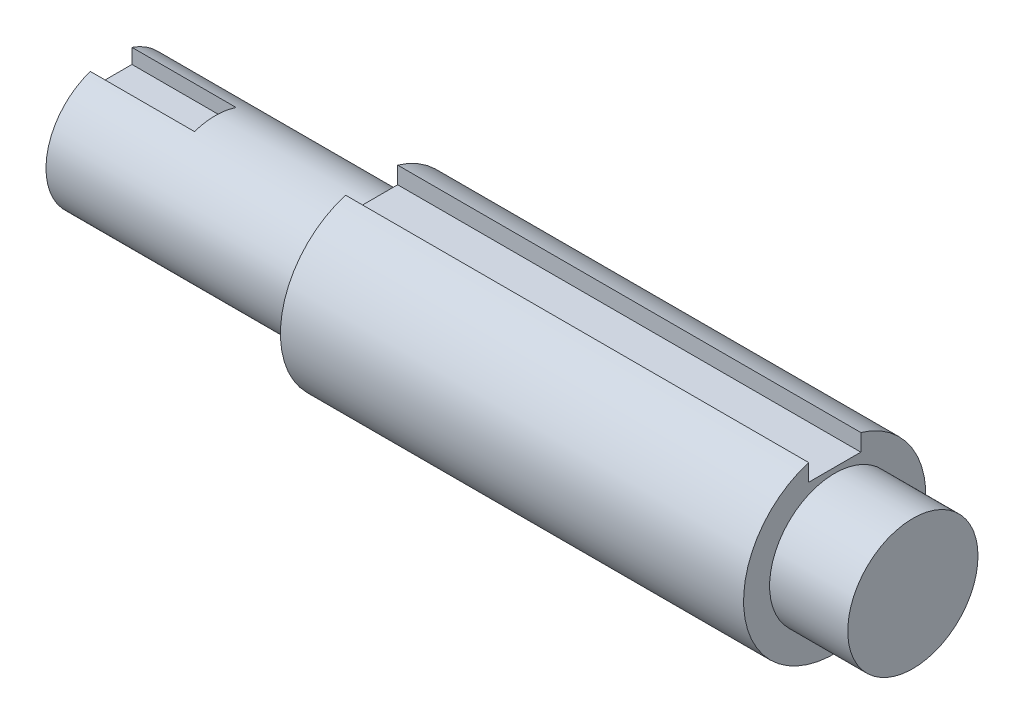
ISO-10303-21;
HEADER;
FILE_DESCRIPTION(('STEP AP214'),'2;1');
FILE_NAME('part.step','',(''),(''),'','','');
FILE_SCHEMA(('AUTOMOTIVE_DESIGN { 1 0 10303 214 1 1 1 1 }'));
ENDSEC;
DATA;
#1=APPLICATION_CONTEXT('core data for automotive mechanical design processes');
#2=APPLICATION_PROTOCOL_DEFINITION('international standard','automotive_design',2000,#1);
#3=PRODUCT_CONTEXT('',#1,'mechanical');
#4=PRODUCT('Part','Part','',(#3));
#5=PRODUCT_RELATED_PRODUCT_CATEGORY('part','',(#4));
#6=PRODUCT_DEFINITION_FORMATION('','',#4);
#7=PRODUCT_DEFINITION_CONTEXT('part definition',#1,'design');
#8=PRODUCT_DEFINITION('design','',#6,#7);
#9=PRODUCT_DEFINITION_SHAPE('','',#8);
#10=(LENGTH_UNIT() NAMED_UNIT(*) SI_UNIT(.MILLI.,.METRE.));
#11=(NAMED_UNIT(*) PLANE_ANGLE_UNIT() SI_UNIT($,.RADIAN.));
#12=(NAMED_UNIT(*) SI_UNIT($,.STERADIAN.) SOLID_ANGLE_UNIT());
#13=UNCERTAINTY_MEASURE_WITH_UNIT(LENGTH_MEASURE(1.E-05),#10,'distance_accuracy_value','');
#14=(GEOMETRIC_REPRESENTATION_CONTEXT(3) GLOBAL_UNCERTAINTY_ASSIGNED_CONTEXT((#13)) GLOBAL_UNIT_ASSIGNED_CONTEXT((#10,
#11,#12)) REPRESENTATION_CONTEXT('',''));
#15=CARTESIAN_POINT('',(0.,0.,0.));
#16=DIRECTION('',(0.,0.,1.));
#17=DIRECTION('',(1.,0.,0.));
#18=AXIS2_PLACEMENT_3D('',#15,#16,#17);
#19=CARTESIAN_POINT('',(20.,0.,4.));
#20=DIRECTION('',(0.,0.,-1.));
#21=DIRECTION('',(0.,1.,0.));
#22=AXIS2_PLACEMENT_3D('',#19,#20,#21);
#23=PLANE('',#22);
#24=DIRECTION('',(0.,-1.,0.));
#25=VECTOR('',#24,1.);
#26=CARTESIAN_POINT('',(0.,0.,4.));
#27=LINE('',#26,#25);
#28=CARTESIAN_POINT('',(0.,11.842719282327,4.));
#29=VERTEX_POINT('',#28);
#30=CARTESIAN_POINT('',(0.,9.,4.));
#31=VERTEX_POINT('',#30);
#32=EDGE_CURVE('E178',#29,#31,#27,.T.);
#33=ORIENTED_EDGE('',*,*,#32,.F.);
#34=DIRECTION('',(-1.,0.,0.));
#35=VECTOR('',#34,1.);
#36=CARTESIAN_POINT('',(20.,11.842719282327,4.));
#37=LINE('',#36,#35);
#38=CARTESIAN_POINT('',(20.,11.842719282327,4.));
#39=VERTEX_POINT('',#38);
#40=EDGE_CURVE('E11',#39,#29,#37,.T.);
#41=ORIENTED_EDGE('',*,*,#40,.F.);
#42=DIRECTION('',(0.,-1.,0.));
#43=VECTOR('',#42,1.);
#44=CARTESIAN_POINT('',(20.,0.,4.));
#45=LINE('',#44,#43);
#46=CARTESIAN_POINT('',(20.,9.,4.));
#47=VERTEX_POINT('',#46);
#48=EDGE_CURVE('E179',#39,#47,#45,.T.);
#49=ORIENTED_EDGE('',*,*,#48,.T.);
#50=DIRECTION('',(-1.,0.,0.));
#51=VECTOR('',#50,1.);
#52=CARTESIAN_POINT('',(20.,9.,4.));
#53=LINE('',#52,#51);
#54=EDGE_CURVE('E81',#47,#31,#53,.T.);
#55=ORIENTED_EDGE('',*,*,#54,.T.);
#56=EDGE_LOOP('',(#33,#41,#49,#55));
#57=FACE_BOUND('',#56,.T.);
#58=ADVANCED_FACE('F43',(#57),#23,.T.);
#59=CARTESIAN_POINT('',(20.,0.,0.));
#60=DIRECTION('',(-1.,0.,0.));
#61=DIRECTION('',(0.,0.,1.));
#62=AXIS2_PLACEMENT_3D('',#59,#60,#61);
#63=CYLINDRICAL_SURFACE('',#62,12.5);
#64=CARTESIAN_POINT('',(0.,0.,0.));
#65=DIRECTION('',(1.,0.,0.));
#66=DIRECTION('',(0.,0.,-1.));
#67=AXIS2_PLACEMENT_3D('',#64,#65,#66);
#68=CIRCLE('',#67,12.5);
#69=CARTESIAN_POINT('',(0.,11.842719282327,-4.));
#70=VERTEX_POINT('',#69);
#71=EDGE_CURVE('E194',#29,#70,#68,.T.);
#72=ORIENTED_EDGE('',*,*,#71,.T.);
#73=DIRECTION('',(-1.,0.,0.));
#74=VECTOR('',#73,1.);
#75=CARTESIAN_POINT('',(20.,11.842719282327,-4.));
#76=LINE('',#75,#74);
#77=CARTESIAN_POINT('',(20.,11.842719282327,-4.));
#78=VERTEX_POINT('',#77);
#79=EDGE_CURVE('E52',#78,#70,#76,.T.);
#80=ORIENTED_EDGE('',*,*,#79,.F.);
#81=CARTESIAN_POINT('',(20.,0.,0.));
#82=DIRECTION('',(1.,0.,0.));
#83=DIRECTION('',(0.,0.,-1.));
#84=AXIS2_PLACEMENT_3D('',#81,#82,#83);
#85=CIRCLE('',#84,12.5);
#86=EDGE_CURVE('E174',#78,#39,#85,.T.);
#87=ORIENTED_EDGE('',*,*,#86,.T.);
#88=ORIENTED_EDGE('',*,*,#40,.T.);
#89=EDGE_LOOP('',(#72,#80,#87,#88));
#90=FACE_BOUND('',#89,.T.);
#91=CARTESIAN_POINT('',(50.,0.,0.));
#92=DIRECTION('',(1.,0.,0.));
#93=DIRECTION('',(0.,0.,-1.));
#94=AXIS2_PLACEMENT_3D('',#91,#92,#93);
#95=CIRCLE('',#94,12.5);
#96=CARTESIAN_POINT('',(50.,0.,-12.5));
#97=VERTEX_POINT('',#96);
#98=EDGE_CURVE('E123',#97,#97,#95,.T.);
#99=ORIENTED_EDGE('',*,*,#98,.F.);
#100=EDGE_LOOP('',(#99));
#101=FACE_BOUND('',#100,.T.);
#102=ADVANCED_FACE('F216',(#90,#101),#63,.T.);
#103=CARTESIAN_POINT('',(20.,0.,-4.));
#104=DIRECTION('',(0.,0.,-1.));
#105=DIRECTION('',(0.,1.,0.));
#106=AXIS2_PLACEMENT_3D('',#103,#104,#105);
#107=PLANE('',#106);
#108=DIRECTION('',(0.,-1.,0.));
#109=VECTOR('',#108,1.);
#110=CARTESIAN_POINT('',(0.,0.,-4.));
#111=LINE('',#110,#109);
#112=CARTESIAN_POINT('',(0.,9.,-4.));
#113=VERTEX_POINT('',#112);
#114=EDGE_CURVE('E75',#70,#113,#111,.T.);
#115=ORIENTED_EDGE('',*,*,#114,.T.);
#116=DIRECTION('',(-1.,0.,0.));
#117=VECTOR('',#116,1.);
#118=CARTESIAN_POINT('',(20.,9.,-4.));
#119=LINE('',#118,#117);
#120=CARTESIAN_POINT('',(20.,9.,-4.));
#121=VERTEX_POINT('',#120);
#122=EDGE_CURVE('E60',#121,#113,#119,.T.);
#123=ORIENTED_EDGE('',*,*,#122,.F.);
#124=DIRECTION('',(0.,-1.,0.));
#125=VECTOR('',#124,1.);
#126=CARTESIAN_POINT('',(20.,0.,-4.));
#127=LINE('',#126,#125);
#128=EDGE_CURVE('E182',#78,#121,#127,.T.);
#129=ORIENTED_EDGE('',*,*,#128,.F.);
#130=ORIENTED_EDGE('',*,*,#79,.T.);
#131=EDGE_LOOP('',(#115,#123,#129,#130));
#132=FACE_BOUND('',#131,.T.);
#133=ADVANCED_FACE('F205',(#132),#107,.F.);
#134=CARTESIAN_POINT('',(20.,9.,0.));
#135=DIRECTION('',(0.,-1.,0.));
#136=DIRECTION('',(0.,0.,-1.));
#137=AXIS2_PLACEMENT_3D('',#134,#135,#136);
#138=PLANE('',#137);
#139=DIRECTION('',(0.,0.,1.));
#140=VECTOR('',#139,1.);
#141=CARTESIAN_POINT('',(0.,9.,0.));
#142=LINE('',#141,#140);
#143=EDGE_CURVE('E183',#113,#31,#142,.T.);
#144=ORIENTED_EDGE('',*,*,#143,.T.);
#145=ORIENTED_EDGE('',*,*,#54,.F.);
#146=DIRECTION('',(0.,0.,1.));
#147=VECTOR('',#146,1.);
#148=CARTESIAN_POINT('',(20.,9.,0.));
#149=LINE('',#148,#147);
#150=EDGE_CURVE('E187',#121,#47,#149,.T.);
#151=ORIENTED_EDGE('',*,*,#150,.F.);
#152=ORIENTED_EDGE('',*,*,#122,.T.);
#153=EDGE_LOOP('',(#144,#145,#151,#152));
#154=FACE_BOUND('',#153,.T.);
#155=ADVANCED_FACE('F213',(#154),#138,.F.);
#156=CARTESIAN_POINT('',(0.,0.,0.));
#157=DIRECTION('',(1.,0.,0.));
#158=DIRECTION('',(0.,0.,-1.));
#159=AXIS2_PLACEMENT_3D('',#156,#157,#158);
#160=PLANE('',#159);
#161=ORIENTED_EDGE('',*,*,#32,.T.);
#162=ORIENTED_EDGE('',*,*,#143,.F.);
#163=ORIENTED_EDGE('',*,*,#114,.F.);
#164=ORIENTED_EDGE('',*,*,#71,.F.);
#165=EDGE_LOOP('',(#161,#162,#163,#164));
#166=FACE_BOUND('',#165,.T.);
#167=ADVANCED_FACE('F211',(#166),#160,.F.);
#168=CARTESIAN_POINT('',(20.,0.,0.));
#169=DIRECTION('',(1.,0.,0.));
#170=DIRECTION('',(0.,0.,-1.));
#171=AXIS2_PLACEMENT_3D('',#168,#169,#170);
#172=PLANE('',#171);
#173=ORIENTED_EDGE('',*,*,#48,.F.);
#174=ORIENTED_EDGE('',*,*,#86,.F.);
#175=ORIENTED_EDGE('',*,*,#128,.T.);
#176=ORIENTED_EDGE('',*,*,#150,.T.);
#177=EDGE_LOOP('',(#173,#174,#175,#176));
#178=FACE_BOUND('',#177,.T.);
#179=ADVANCED_FACE('F215',(#178),#172,.F.);
#180=CARTESIAN_POINT('',(138.9,0.,5.));
#181=DIRECTION('',(0.,0.,-1.));
#182=DIRECTION('',(0.,1.,0.));
#183=AXIS2_PLACEMENT_3D('',#180,#181,#182);
#184=PLANE('',#183);
#185=DIRECTION('',(0.,-1.,0.));
#186=VECTOR('',#185,1.);
#187=CARTESIAN_POINT('',(50.,0.,5.));
#188=LINE('',#187,#186);
#189=CARTESIAN_POINT('',(50.,16.7705098312484,5.));
#190=VERTEX_POINT('',#189);
#191=CARTESIAN_POINT('',(50.,13.5,5.));
#192=VERTEX_POINT('',#191);
#193=EDGE_CURVE('E119',#190,#192,#188,.T.);
#194=ORIENTED_EDGE('',*,*,#193,.F.);
#195=DIRECTION('',(-1.,0.,0.));
#196=VECTOR('',#195,1.);
#197=CARTESIAN_POINT('',(138.9,16.7705098312484,5.));
#198=LINE('',#197,#196);
#199=CARTESIAN_POINT('',(138.9,16.7705098312484,5.));
#200=VERTEX_POINT('',#199);
#201=EDGE_CURVE('E113',#200,#190,#198,.T.);
#202=ORIENTED_EDGE('',*,*,#201,.F.);
#203=DIRECTION('',(0.,-1.,0.));
#204=VECTOR('',#203,1.);
#205=CARTESIAN_POINT('',(138.9,0.,5.));
#206=LINE('',#205,#204);
#207=CARTESIAN_POINT('',(138.9,13.5,5.));
#208=VERTEX_POINT('',#207);
#209=EDGE_CURVE('E117',#200,#208,#206,.T.);
#210=ORIENTED_EDGE('',*,*,#209,.T.);
#211=DIRECTION('',(-1.,0.,0.));
#212=VECTOR('',#211,1.);
#213=CARTESIAN_POINT('',(138.9,13.5,5.));
#214=LINE('',#213,#212);
#215=EDGE_CURVE('E154',#208,#192,#214,.T.);
#216=ORIENTED_EDGE('',*,*,#215,.T.);
#217=EDGE_LOOP('',(#194,#202,#210,#216));
#218=FACE_BOUND('',#217,.T.);
#219=ADVANCED_FACE('F115',(#218),#184,.T.);
#220=CARTESIAN_POINT('',(138.9,0.,0.));
#221=DIRECTION('',(-1.,0.,0.));
#222=DIRECTION('',(0.,0.,1.));
#223=AXIS2_PLACEMENT_3D('',#220,#221,#222);
#224=CYLINDRICAL_SURFACE('',#223,17.5);
#225=CARTESIAN_POINT('',(50.,0.,0.));
#226=DIRECTION('',(1.,0.,0.));
#227=DIRECTION('',(0.,0.,-1.));
#228=AXIS2_PLACEMENT_3D('',#225,#226,#227);
#229=CIRCLE('',#228,17.5);
#230=CARTESIAN_POINT('',(50.,16.7705098312484,-5.));
#231=VERTEX_POINT('',#230);
#232=EDGE_CURVE('E157',#190,#231,#229,.T.);
#233=ORIENTED_EDGE('',*,*,#232,.T.);
#234=DIRECTION('',(-1.,0.,0.));
#235=VECTOR('',#234,1.);
#236=CARTESIAN_POINT('',(138.9,16.7705098312484,-5.));
#237=LINE('',#236,#235);
#238=CARTESIAN_POINT('',(138.9,16.7705098312484,-5.));
#239=VERTEX_POINT('',#238);
#240=EDGE_CURVE('E124',#239,#231,#237,.T.);
#241=ORIENTED_EDGE('',*,*,#240,.F.);
#242=CARTESIAN_POINT('',(138.9,0.,0.));
#243=DIRECTION('',(1.,0.,0.));
#244=DIRECTION('',(0.,0.,-1.));
#245=AXIS2_PLACEMENT_3D('',#242,#243,#244);
#246=CIRCLE('',#245,17.5);
#247=EDGE_CURVE('E127',#200,#239,#246,.T.);
#248=ORIENTED_EDGE('',*,*,#247,.F.);
#249=ORIENTED_EDGE('',*,*,#201,.T.);
#250=EDGE_LOOP('',(#233,#241,#248,#249));
#251=FACE_BOUND('',#250,.T.);
#252=ADVANCED_FACE('F128',(#251),#224,.T.);
#253=CARTESIAN_POINT('',(138.9,0.,-5.));
#254=DIRECTION('',(0.,0.,-1.));
#255=DIRECTION('',(0.,1.,0.));
#256=AXIS2_PLACEMENT_3D('',#253,#254,#255);
#257=PLANE('',#256);
#258=DIRECTION('',(0.,-1.,0.));
#259=VECTOR('',#258,1.);
#260=CARTESIAN_POINT('',(50.,0.,-5.));
#261=LINE('',#260,#259);
#262=CARTESIAN_POINT('',(50.,13.5,-5.));
#263=VERTEX_POINT('',#262);
#264=EDGE_CURVE('E144',#231,#263,#261,.T.);
#265=ORIENTED_EDGE('',*,*,#264,.T.);
#266=DIRECTION('',(-1.,0.,0.));
#267=VECTOR('',#266,1.);
#268=CARTESIAN_POINT('',(138.9,13.5,-5.));
#269=LINE('',#268,#267);
#270=CARTESIAN_POINT('',(138.9,13.5,-5.));
#271=VERTEX_POINT('',#270);
#272=EDGE_CURVE('E165',#271,#263,#269,.T.);
#273=ORIENTED_EDGE('',*,*,#272,.F.);
#274=DIRECTION('',(0.,-1.,0.));
#275=VECTOR('',#274,1.);
#276=CARTESIAN_POINT('',(138.9,0.,-5.));
#277=LINE('',#276,#275);
#278=EDGE_CURVE('E133',#239,#271,#277,.T.);
#279=ORIENTED_EDGE('',*,*,#278,.F.);
#280=ORIENTED_EDGE('',*,*,#240,.T.);
#281=EDGE_LOOP('',(#265,#273,#279,#280));
#282=FACE_BOUND('',#281,.T.);
#283=ADVANCED_FACE('F229',(#282),#257,.F.);
#284=CARTESIAN_POINT('',(138.9,13.5,0.));
#285=DIRECTION('',(0.,-1.,0.));
#286=DIRECTION('',(0.,0.,-1.));
#287=AXIS2_PLACEMENT_3D('',#284,#285,#286);
#288=PLANE('',#287);
#289=DIRECTION('',(0.,0.,1.));
#290=VECTOR('',#289,1.);
#291=CARTESIAN_POINT('',(50.,13.5,0.));
#292=LINE('',#291,#290);
#293=EDGE_CURVE('E140',#263,#192,#292,.T.);
#294=ORIENTED_EDGE('',*,*,#293,.T.);
#295=ORIENTED_EDGE('',*,*,#215,.F.);
#296=DIRECTION('',(0.,0.,1.));
#297=VECTOR('',#296,1.);
#298=CARTESIAN_POINT('',(138.9,13.5,0.));
#299=LINE('',#298,#297);
#300=EDGE_CURVE('E137',#271,#208,#299,.T.);
#301=ORIENTED_EDGE('',*,*,#300,.F.);
#302=ORIENTED_EDGE('',*,*,#272,.T.);
#303=EDGE_LOOP('',(#294,#295,#301,#302));
#304=FACE_BOUND('',#303,.T.);
#305=ADVANCED_FACE('F232',(#304),#288,.F.);
#306=CARTESIAN_POINT('',(138.9,0.,0.));
#307=DIRECTION('',(1.,0.,0.));
#308=DIRECTION('',(0.,0.,-1.));
#309=AXIS2_PLACEMENT_3D('',#306,#307,#308);
#310=PLANE('',#309);
#311=CARTESIAN_POINT('',(138.9,0.,0.));
#312=DIRECTION('',(1.,0.,0.));
#313=DIRECTION('',(0.,0.,-1.));
#314=AXIS2_PLACEMENT_3D('',#311,#312,#313);
#315=CIRCLE('',#314,12.5);
#316=CARTESIAN_POINT('',(138.9,0.,-12.5));
#317=VERTEX_POINT('',#316);
#318=EDGE_CURVE('E147',#317,#317,#315,.T.);
#319=ORIENTED_EDGE('',*,*,#318,.F.);
#320=EDGE_LOOP('',(#319));
#321=FACE_BOUND('',#320,.T.);
#322=ORIENTED_EDGE('',*,*,#209,.F.);
#323=ORIENTED_EDGE('',*,*,#247,.T.);
#324=ORIENTED_EDGE('',*,*,#278,.T.);
#325=ORIENTED_EDGE('',*,*,#300,.T.);
#326=EDGE_LOOP('',(#322,#323,#324,#325));
#327=FACE_BOUND('',#326,.T.);
#328=ADVANCED_FACE('F135',(#321,#327),#310,.T.);
#329=CARTESIAN_POINT('',(50.,0.,0.));
#330=DIRECTION('',(1.,0.,0.));
#331=DIRECTION('',(0.,0.,-1.));
#332=AXIS2_PLACEMENT_3D('',#329,#330,#331);
#333=PLANE('',#332);
#334=ORIENTED_EDGE('',*,*,#98,.T.);
#335=EDGE_LOOP('',(#334));
#336=FACE_BOUND('',#335,.T.);
#337=ORIENTED_EDGE('',*,*,#193,.T.);
#338=ORIENTED_EDGE('',*,*,#293,.F.);
#339=ORIENTED_EDGE('',*,*,#264,.F.);
#340=ORIENTED_EDGE('',*,*,#232,.F.);
#341=EDGE_LOOP('',(#337,#338,#339,#340));
#342=FACE_BOUND('',#341,.T.);
#343=ADVANCED_FACE('F221',(#336,#342),#333,.F.);
#344=CARTESIAN_POINT('',(153.9,0.,0.));
#345=DIRECTION('',(-1.,0.,0.));
#346=DIRECTION('',(0.,0.,1.));
#347=AXIS2_PLACEMENT_3D('',#344,#345,#346);
#348=CYLINDRICAL_SURFACE('',#347,12.5);
#349=CARTESIAN_POINT('',(153.9,0.,0.));
#350=DIRECTION('',(1.,0.,0.));
#351=DIRECTION('',(0.,0.,-1.));
#352=AXIS2_PLACEMENT_3D('',#349,#350,#351);
#353=CIRCLE('',#352,12.5);
#354=CARTESIAN_POINT('',(153.9,0.,-12.5));
#355=VERTEX_POINT('',#354);
#356=EDGE_CURVE('E158',#355,#355,#353,.T.);
#357=ORIENTED_EDGE('',*,*,#356,.F.);
#358=EDGE_LOOP('',(#357));
#359=FACE_BOUND('',#358,.T.);
#360=ORIENTED_EDGE('',*,*,#318,.T.);
#361=EDGE_LOOP('',(#360));
#362=FACE_BOUND('',#361,.T.);
#363=ADVANCED_FACE('F224',(#359,#362),#348,.T.);
#364=CARTESIAN_POINT('',(153.9,0.,0.));
#365=DIRECTION('',(1.,0.,0.));
#366=DIRECTION('',(0.,0.,-1.));
#367=AXIS2_PLACEMENT_3D('',#364,#365,#366);
#368=PLANE('',#367);
#369=ORIENTED_EDGE('',*,*,#356,.T.);
#370=EDGE_LOOP('',(#369));
#371=FACE_BOUND('',#370,.T.);
#372=ADVANCED_FACE('F314',(#371),#368,.T.);
#373=CLOSED_SHELL('',(#58,#102,#133,#155,#167,#179,#219,#252,#283,#305,#328,#343,#363,#372));
#374=MANIFOLD_SOLID_BREP('B2',#373);
#375=ADVANCED_BREP_SHAPE_REPRESENTATION('',(#18,#374),#14);
#376=SHAPE_DEFINITION_REPRESENTATION(#9,#375);
ENDSEC;
END-ISO-10303-21;
